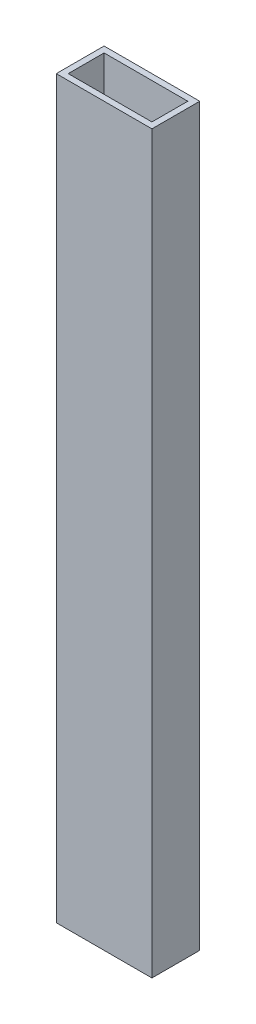
ISO-10303-21;
HEADER;
FILE_DESCRIPTION(('STEP AP214'),'2;1');
FILE_NAME('part.step','',(''),(''),'','','');
FILE_SCHEMA(('AUTOMOTIVE_DESIGN { 1 0 10303 214 1 1 1 1 }'));
ENDSEC;
DATA;
#1=APPLICATION_CONTEXT('core data for automotive mechanical design processes');
#2=APPLICATION_PROTOCOL_DEFINITION('international standard','automotive_design',2000,#1);
#3=PRODUCT_CONTEXT('',#1,'mechanical');
#4=PRODUCT('Part','Part','',(#3));
#5=PRODUCT_RELATED_PRODUCT_CATEGORY('part','',(#4));
#6=PRODUCT_DEFINITION_FORMATION('','',#4);
#7=PRODUCT_DEFINITION_CONTEXT('part definition',#1,'design');
#8=PRODUCT_DEFINITION('design','',#6,#7);
#9=PRODUCT_DEFINITION_SHAPE('','',#8);
#10=(LENGTH_UNIT() NAMED_UNIT(*) SI_UNIT(.MILLI.,.METRE.));
#11=(NAMED_UNIT(*) PLANE_ANGLE_UNIT() SI_UNIT($,.RADIAN.));
#12=(NAMED_UNIT(*) SI_UNIT($,.STERADIAN.) SOLID_ANGLE_UNIT());
#13=UNCERTAINTY_MEASURE_WITH_UNIT(LENGTH_MEASURE(1.E-05),#10,'distance_accuracy_value','');
#14=(GEOMETRIC_REPRESENTATION_CONTEXT(3) GLOBAL_UNCERTAINTY_ASSIGNED_CONTEXT((#13)) GLOBAL_UNIT_ASSIGNED_CONTEXT((#10,
#11,#12)) REPRESENTATION_CONTEXT('',''));
#15=CARTESIAN_POINT('',(0.,0.,0.));
#16=DIRECTION('',(0.,0.,1.));
#17=DIRECTION('',(1.,0.,0.));
#18=AXIS2_PLACEMENT_3D('',#15,#16,#17);
#19=CARTESIAN_POINT('',(0.,390.525,0.));
#20=DIRECTION('',(0.,-1.,0.));
#21=DIRECTION('',(0.,0.,-1.));
#22=AXIS2_PLACEMENT_3D('',#19,#20,#21);
#23=PLANE('',#22);
#24=DIRECTION('',(0.,0.,1.));
#25=VECTOR('',#24,1.);
#26=CARTESIAN_POINT('',(0.,390.525,0.));
#27=LINE('',#26,#25);
#28=CARTESIAN_POINT('',(0.,390.525,-25.4));
#29=VERTEX_POINT('',#28);
#30=CARTESIAN_POINT('',(0.,390.525,0.));
#31=VERTEX_POINT('',#30);
#32=EDGE_CURVE('E134',#29,#31,#27,.T.);
#33=ORIENTED_EDGE('',*,*,#32,.T.);
#34=DIRECTION('',(1.,0.,0.));
#35=VECTOR('',#34,1.);
#36=CARTESIAN_POINT('',(0.,390.525,0.));
#37=LINE('',#36,#35);
#38=CARTESIAN_POINT('',(50.8,390.525,0.));
#39=VERTEX_POINT('',#38);
#40=EDGE_CURVE('E137',#31,#39,#37,.T.);
#41=ORIENTED_EDGE('',*,*,#40,.T.);
#42=DIRECTION('',(0.,0.,-1.));
#43=VECTOR('',#42,1.);
#44=CARTESIAN_POINT('',(50.8,390.525,0.));
#45=LINE('',#44,#43);
#46=CARTESIAN_POINT('',(50.8,390.525,-25.4));
#47=VERTEX_POINT('',#46);
#48=EDGE_CURVE('E140',#39,#47,#45,.T.);
#49=ORIENTED_EDGE('',*,*,#48,.T.);
#50=DIRECTION('',(-1.,0.,0.));
#51=VECTOR('',#50,1.);
#52=CARTESIAN_POINT('',(0.,390.525,-25.4));
#53=LINE('',#52,#51);
#54=EDGE_CURVE('E142',#47,#29,#53,.T.);
#55=ORIENTED_EDGE('',*,*,#54,.T.);
#56=EDGE_LOOP('',(#33,#41,#49,#55));
#57=FACE_BOUND('',#56,.T.);
#58=DIRECTION('',(0.,0.,1.));
#59=VECTOR('',#58,1.);
#60=CARTESIAN_POINT('',(3.175,390.525,-22.225));
#61=LINE('',#60,#59);
#62=CARTESIAN_POINT('',(3.175,390.525,-22.225));
#63=VERTEX_POINT('',#62);
#64=CARTESIAN_POINT('',(3.175,390.525,-3.175));
#65=VERTEX_POINT('',#64);
#66=EDGE_CURVE('E98',#63,#65,#61,.T.);
#67=ORIENTED_EDGE('',*,*,#66,.F.);
#68=DIRECTION('',(-1.,0.,0.));
#69=VECTOR('',#68,1.);
#70=CARTESIAN_POINT('',(3.175,390.525,-22.225));
#71=LINE('',#70,#69);
#72=CARTESIAN_POINT('',(47.625,390.525,-22.225));
#73=VERTEX_POINT('',#72);
#74=EDGE_CURVE('E120',#73,#63,#71,.T.);
#75=ORIENTED_EDGE('',*,*,#74,.F.);
#76=DIRECTION('',(0.,0.,-1.));
#77=VECTOR('',#76,1.);
#78=CARTESIAN_POINT('',(47.625,390.525,-22.225));
#79=LINE('',#78,#77);
#80=CARTESIAN_POINT('',(47.625,390.525,-3.175));
#81=VERTEX_POINT('',#80);
#82=EDGE_CURVE('E118',#81,#73,#79,.T.);
#83=ORIENTED_EDGE('',*,*,#82,.F.);
#84=DIRECTION('',(1.,0.,0.));
#85=VECTOR('',#84,1.);
#86=CARTESIAN_POINT('',(3.175,390.525,-3.175));
#87=LINE('',#86,#85);
#88=EDGE_CURVE('E106',#65,#81,#87,.T.);
#89=ORIENTED_EDGE('',*,*,#88,.F.);
#90=EDGE_LOOP('',(#67,#75,#83,#89));
#91=FACE_BOUND('',#90,.T.);
#92=ADVANCED_FACE('F33',(#57,#91),#23,.F.);
#93=CARTESIAN_POINT('',(0.,0.,0.));
#94=DIRECTION('',(0.,-1.,0.));
#95=DIRECTION('',(0.,0.,-1.));
#96=AXIS2_PLACEMENT_3D('',#93,#94,#95);
#97=PLANE('',#96);
#98=DIRECTION('',(0.,0.,1.));
#99=VECTOR('',#98,1.);
#100=CARTESIAN_POINT('',(0.,0.,0.));
#101=LINE('',#100,#99);
#102=CARTESIAN_POINT('',(0.,0.,-25.4));
#103=VERTEX_POINT('',#102);
#104=CARTESIAN_POINT('',(0.,0.,0.));
#105=VERTEX_POINT('',#104);
#106=EDGE_CURVE('E114',#103,#105,#101,.T.);
#107=ORIENTED_EDGE('',*,*,#106,.F.);
#108=DIRECTION('',(-1.,0.,0.));
#109=VECTOR('',#108,1.);
#110=CARTESIAN_POINT('',(0.,0.,-25.4));
#111=LINE('',#110,#109);
#112=CARTESIAN_POINT('',(50.8,0.,-25.4));
#113=VERTEX_POINT('',#112);
#114=EDGE_CURVE('E138',#113,#103,#111,.T.);
#115=ORIENTED_EDGE('',*,*,#114,.F.);
#116=DIRECTION('',(0.,0.,-1.));
#117=VECTOR('',#116,1.);
#118=CARTESIAN_POINT('',(50.8,0.,0.));
#119=LINE('',#118,#117);
#120=CARTESIAN_POINT('',(50.8,0.,0.));
#121=VERTEX_POINT('',#120);
#122=EDGE_CURVE('E149',#121,#113,#119,.T.);
#123=ORIENTED_EDGE('',*,*,#122,.F.);
#124=DIRECTION('',(1.,0.,0.));
#125=VECTOR('',#124,1.);
#126=CARTESIAN_POINT('',(0.,0.,0.));
#127=LINE('',#126,#125);
#128=EDGE_CURVE('E147',#105,#121,#127,.T.);
#129=ORIENTED_EDGE('',*,*,#128,.F.);
#130=EDGE_LOOP('',(#107,#115,#123,#129));
#131=FACE_BOUND('',#130,.T.);
#132=DIRECTION('',(-1.,0.,0.));
#133=VECTOR('',#132,1.);
#134=CARTESIAN_POINT('',(3.175,0.,-22.225));
#135=LINE('',#134,#133);
#136=CARTESIAN_POINT('',(47.625,0.,-22.225));
#137=VERTEX_POINT('',#136);
#138=CARTESIAN_POINT('',(3.175,0.,-22.225));
#139=VERTEX_POINT('',#138);
#140=EDGE_CURVE('E107',#137,#139,#135,.T.);
#141=ORIENTED_EDGE('',*,*,#140,.T.);
#142=DIRECTION('',(0.,0.,1.));
#143=VECTOR('',#142,1.);
#144=CARTESIAN_POINT('',(3.175,0.,-22.225));
#145=LINE('',#144,#143);
#146=CARTESIAN_POINT('',(3.175,0.,-3.175));
#147=VERTEX_POINT('',#146);
#148=EDGE_CURVE('E56',#139,#147,#145,.T.);
#149=ORIENTED_EDGE('',*,*,#148,.T.);
#150=DIRECTION('',(1.,0.,0.));
#151=VECTOR('',#150,1.);
#152=CARTESIAN_POINT('',(3.175,0.,-3.175));
#153=LINE('',#152,#151);
#154=CARTESIAN_POINT('',(47.625,0.,-3.175));
#155=VERTEX_POINT('',#154);
#156=EDGE_CURVE('E113',#147,#155,#153,.T.);
#157=ORIENTED_EDGE('',*,*,#156,.T.);
#158=DIRECTION('',(0.,0.,-1.));
#159=VECTOR('',#158,1.);
#160=CARTESIAN_POINT('',(47.625,0.,-22.225));
#161=LINE('',#160,#159);
#162=EDGE_CURVE('E126',#155,#137,#161,.T.);
#163=ORIENTED_EDGE('',*,*,#162,.T.);
#164=EDGE_LOOP('',(#141,#149,#157,#163));
#165=FACE_BOUND('',#164,.T.);
#166=ADVANCED_FACE('F167',(#131,#165),#97,.T.);
#167=CARTESIAN_POINT('',(0.,390.525,0.));
#168=DIRECTION('',(1.,0.,0.));
#169=DIRECTION('',(0.,0.,-1.));
#170=AXIS2_PLACEMENT_3D('',#167,#168,#169);
#171=PLANE('',#170);
#172=ORIENTED_EDGE('',*,*,#106,.T.);
#173=DIRECTION('',(0.,-1.,0.));
#174=VECTOR('',#173,1.);
#175=CARTESIAN_POINT('',(0.,390.525,0.));
#176=LINE('',#175,#174);
#177=EDGE_CURVE('E11',#31,#105,#176,.T.);
#178=ORIENTED_EDGE('',*,*,#177,.F.);
#179=ORIENTED_EDGE('',*,*,#32,.F.);
#180=DIRECTION('',(0.,-1.,0.));
#181=VECTOR('',#180,1.);
#182=CARTESIAN_POINT('',(0.,390.525,-25.4));
#183=LINE('',#182,#181);
#184=EDGE_CURVE('E144',#29,#103,#183,.T.);
#185=ORIENTED_EDGE('',*,*,#184,.T.);
#186=EDGE_LOOP('',(#172,#178,#179,#185));
#187=FACE_BOUND('',#186,.T.);
#188=ADVANCED_FACE('F35',(#187),#171,.F.);
#189=CARTESIAN_POINT('',(0.,390.525,0.));
#190=DIRECTION('',(0.,0.,-1.));
#191=DIRECTION('',(-1.,0.,0.));
#192=AXIS2_PLACEMENT_3D('',#189,#190,#191);
#193=PLANE('',#192);
#194=ORIENTED_EDGE('',*,*,#128,.T.);
#195=DIRECTION('',(0.,-1.,0.));
#196=VECTOR('',#195,1.);
#197=CARTESIAN_POINT('',(50.8,390.525,0.));
#198=LINE('',#197,#196);
#199=EDGE_CURVE('E41',#39,#121,#198,.T.);
#200=ORIENTED_EDGE('',*,*,#199,.F.);
#201=ORIENTED_EDGE('',*,*,#40,.F.);
#202=ORIENTED_EDGE('',*,*,#177,.T.);
#203=EDGE_LOOP('',(#194,#200,#201,#202));
#204=FACE_BOUND('',#203,.T.);
#205=ADVANCED_FACE('F177',(#204),#193,.F.);
#206=CARTESIAN_POINT('',(50.8,390.525,0.));
#207=DIRECTION('',(-1.,0.,0.));
#208=DIRECTION('',(0.,0.,1.));
#209=AXIS2_PLACEMENT_3D('',#206,#207,#208);
#210=PLANE('',#209);
#211=ORIENTED_EDGE('',*,*,#122,.T.);
#212=DIRECTION('',(0.,-1.,0.));
#213=VECTOR('',#212,1.);
#214=CARTESIAN_POINT('',(50.8,390.525,-25.4));
#215=LINE('',#214,#213);
#216=EDGE_CURVE('E154',#47,#113,#215,.T.);
#217=ORIENTED_EDGE('',*,*,#216,.F.);
#218=ORIENTED_EDGE('',*,*,#48,.F.);
#219=ORIENTED_EDGE('',*,*,#199,.T.);
#220=EDGE_LOOP('',(#211,#217,#218,#219));
#221=FACE_BOUND('',#220,.T.);
#222=ADVANCED_FACE('F161',(#221),#210,.F.);
#223=CARTESIAN_POINT('',(0.,390.525,-25.4));
#224=DIRECTION('',(0.,0.,1.));
#225=DIRECTION('',(1.,0.,0.));
#226=AXIS2_PLACEMENT_3D('',#223,#224,#225);
#227=PLANE('',#226);
#228=ORIENTED_EDGE('',*,*,#114,.T.);
#229=ORIENTED_EDGE('',*,*,#184,.F.);
#230=ORIENTED_EDGE('',*,*,#54,.F.);
#231=ORIENTED_EDGE('',*,*,#216,.T.);
#232=EDGE_LOOP('',(#228,#229,#230,#231));
#233=FACE_BOUND('',#232,.T.);
#234=ADVANCED_FACE('F171',(#233),#227,.F.);
#235=CARTESIAN_POINT('',(3.175,390.525,-22.225));
#236=DIRECTION('',(1.,0.,0.));
#237=DIRECTION('',(0.,0.,-1.));
#238=AXIS2_PLACEMENT_3D('',#235,#236,#237);
#239=PLANE('',#238);
#240=ORIENTED_EDGE('',*,*,#148,.F.);
#241=DIRECTION('',(0.,-1.,0.));
#242=VECTOR('',#241,1.);
#243=CARTESIAN_POINT('',(3.175,390.525,-22.225));
#244=LINE('',#243,#242);
#245=EDGE_CURVE('E102',#63,#139,#244,.T.);
#246=ORIENTED_EDGE('',*,*,#245,.F.);
#247=ORIENTED_EDGE('',*,*,#66,.T.);
#248=DIRECTION('',(0.,-1.,0.));
#249=VECTOR('',#248,1.);
#250=CARTESIAN_POINT('',(3.175,390.525,-3.175));
#251=LINE('',#250,#249);
#252=EDGE_CURVE('E101',#65,#147,#251,.T.);
#253=ORIENTED_EDGE('',*,*,#252,.T.);
#254=EDGE_LOOP('',(#240,#246,#247,#253));
#255=FACE_BOUND('',#254,.T.);
#256=ADVANCED_FACE('F100',(#255),#239,.T.);
#257=CARTESIAN_POINT('',(3.175,390.525,-3.175));
#258=DIRECTION('',(0.,0.,-1.));
#259=DIRECTION('',(-1.,0.,0.));
#260=AXIS2_PLACEMENT_3D('',#257,#258,#259);
#261=PLANE('',#260);
#262=ORIENTED_EDGE('',*,*,#156,.F.);
#263=ORIENTED_EDGE('',*,*,#252,.F.);
#264=ORIENTED_EDGE('',*,*,#88,.T.);
#265=DIRECTION('',(0.,-1.,0.));
#266=VECTOR('',#265,1.);
#267=CARTESIAN_POINT('',(47.625,390.525,-3.175));
#268=LINE('',#267,#266);
#269=EDGE_CURVE('E115',#81,#155,#268,.T.);
#270=ORIENTED_EDGE('',*,*,#269,.T.);
#271=EDGE_LOOP('',(#262,#263,#264,#270));
#272=FACE_BOUND('',#271,.T.);
#273=ADVANCED_FACE('F110',(#272),#261,.T.);
#274=CARTESIAN_POINT('',(47.625,390.525,-22.225));
#275=DIRECTION('',(-1.,0.,0.));
#276=DIRECTION('',(0.,0.,1.));
#277=AXIS2_PLACEMENT_3D('',#274,#275,#276);
#278=PLANE('',#277);
#279=ORIENTED_EDGE('',*,*,#162,.F.);
#280=ORIENTED_EDGE('',*,*,#269,.F.);
#281=ORIENTED_EDGE('',*,*,#82,.T.);
#282=DIRECTION('',(0.,-1.,0.));
#283=VECTOR('',#282,1.);
#284=CARTESIAN_POINT('',(47.625,390.525,-22.225));
#285=LINE('',#284,#283);
#286=EDGE_CURVE('E48',#73,#137,#285,.T.);
#287=ORIENTED_EDGE('',*,*,#286,.T.);
#288=EDGE_LOOP('',(#279,#280,#281,#287));
#289=FACE_BOUND('',#288,.T.);
#290=ADVANCED_FACE('F200',(#289),#278,.T.);
#291=CARTESIAN_POINT('',(3.175,390.525,-22.225));
#292=DIRECTION('',(0.,0.,1.));
#293=DIRECTION('',(1.,0.,0.));
#294=AXIS2_PLACEMENT_3D('',#291,#292,#293);
#295=PLANE('',#294);
#296=ORIENTED_EDGE('',*,*,#140,.F.);
#297=ORIENTED_EDGE('',*,*,#286,.F.);
#298=ORIENTED_EDGE('',*,*,#74,.T.);
#299=ORIENTED_EDGE('',*,*,#245,.T.);
#300=EDGE_LOOP('',(#296,#297,#298,#299));
#301=FACE_BOUND('',#300,.T.);
#302=ADVANCED_FACE('F204',(#301),#295,.T.);
#303=CLOSED_SHELL('',(#92,#166,#188,#205,#222,#234,#256,#273,#290,#302));
#304=MANIFOLD_SOLID_BREP('B2',#303);
#305=ADVANCED_BREP_SHAPE_REPRESENTATION('',(#18,#304),#14);
#306=SHAPE_DEFINITION_REPRESENTATION(#9,#305);
ENDSEC;
END-ISO-10303-21;
